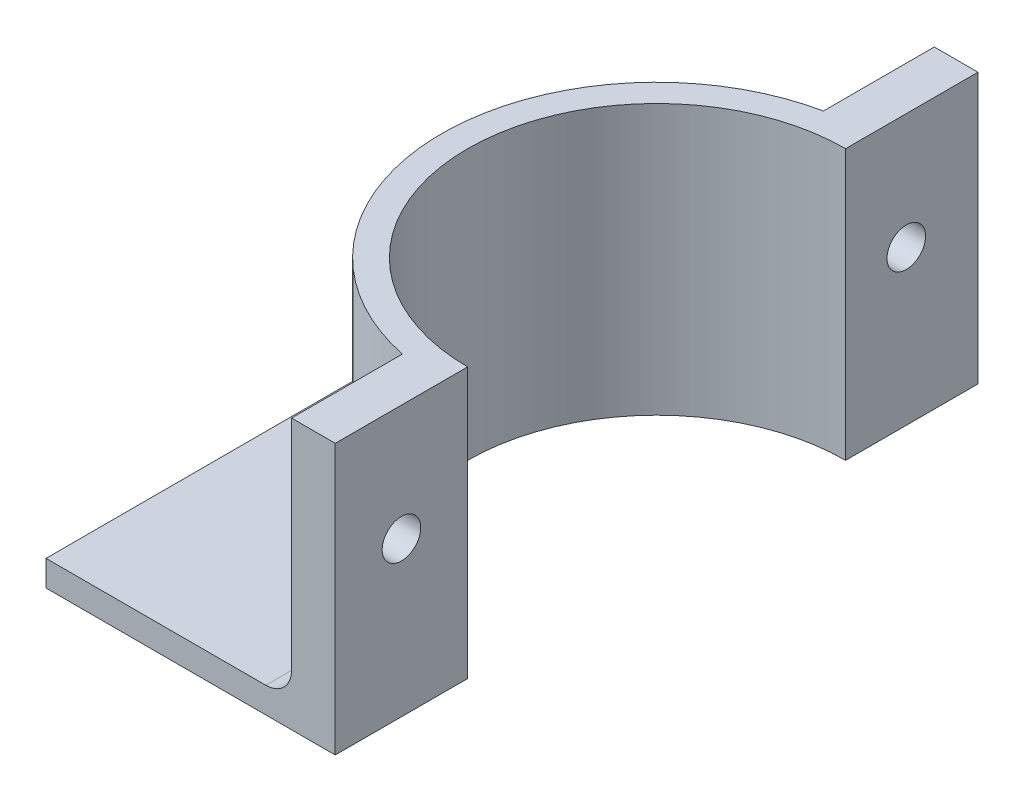
ISO-10303-21;
HEADER;
FILE_DESCRIPTION(('STEP AP214'),'2;1');
FILE_NAME('part.step','',(''),(''),'','','');
FILE_SCHEMA(('AUTOMOTIVE_DESIGN { 1 0 10303 214 1 1 1 1 }'));
ENDSEC;
DATA;
#1=APPLICATION_CONTEXT('core data for automotive mechanical design processes');
#2=APPLICATION_PROTOCOL_DEFINITION('international standard','automotive_design',2000,#1);
#3=PRODUCT_CONTEXT('',#1,'mechanical');
#4=PRODUCT('Part','Part','',(#3));
#5=PRODUCT_RELATED_PRODUCT_CATEGORY('part','',(#4));
#6=PRODUCT_DEFINITION_FORMATION('','',#4);
#7=PRODUCT_DEFINITION_CONTEXT('part definition',#1,'design');
#8=PRODUCT_DEFINITION('design','',#6,#7);
#9=PRODUCT_DEFINITION_SHAPE('','',#8);
#10=(LENGTH_UNIT() NAMED_UNIT(*) SI_UNIT(.MILLI.,.METRE.));
#11=(NAMED_UNIT(*) PLANE_ANGLE_UNIT() SI_UNIT($,.RADIAN.));
#12=(NAMED_UNIT(*) SI_UNIT($,.STERADIAN.) SOLID_ANGLE_UNIT());
#13=UNCERTAINTY_MEASURE_WITH_UNIT(LENGTH_MEASURE(1.E-05),#10,'distance_accuracy_value','');
#14=(GEOMETRIC_REPRESENTATION_CONTEXT(3) GLOBAL_UNCERTAINTY_ASSIGNED_CONTEXT((#13)) GLOBAL_UNIT_ASSIGNED_CONTEXT((#10,
#11,#12)) REPRESENTATION_CONTEXT('',''));
#15=CARTESIAN_POINT('',(0.,0.,0.));
#16=DIRECTION('',(0.,0.,1.));
#17=DIRECTION('',(1.,0.,0.));
#18=AXIS2_PLACEMENT_3D('',#15,#16,#17);
#19=CARTESIAN_POINT('',(0.,2.54,-63.5));
#20=DIRECTION('',(0.,0.,-1.));
#21=DIRECTION('',(-1.,0.,0.));
#22=AXIS2_PLACEMENT_3D('',#19,#20,#21);
#23=PLANE('',#22);
#24=DIRECTION('',(1.,0.,0.));
#25=VECTOR('',#24,1.);
#26=CARTESIAN_POINT('',(0.,0.,-63.5));
#27=LINE('',#26,#25);
#28=CARTESIAN_POINT('',(0.,0.,-63.5));
#29=VERTEX_POINT('',#28);
#30=CARTESIAN_POINT('',(28.575,0.,-63.5));
#31=VERTEX_POINT('',#30);
#32=EDGE_CURVE('E169',#29,#31,#27,.T.);
#33=ORIENTED_EDGE('',*,*,#32,.F.);
#34=DIRECTION('',(0.,-1.,0.));
#35=VECTOR('',#34,1.);
#36=CARTESIAN_POINT('',(0.,2.54,-63.5));
#37=LINE('',#36,#35);
#38=CARTESIAN_POINT('',(0.,2.54,-63.5));
#39=VERTEX_POINT('',#38);
#40=EDGE_CURVE('E200',#39,#29,#37,.T.);
#41=ORIENTED_EDGE('',*,*,#40,.F.);
#42=DIRECTION('',(1.,0.,0.));
#43=VECTOR('',#42,1.);
#44=CARTESIAN_POINT('',(0.,2.54,-63.5));
#45=LINE('',#44,#43);
#46=CARTESIAN_POINT('',(21.717,2.54,-63.5));
#47=VERTEX_POINT('',#46);
#48=EDGE_CURVE('E179',#39,#47,#45,.T.);
#49=ORIENTED_EDGE('',*,*,#48,.T.);
#50=CARTESIAN_POINT('',(21.717,5.08,-63.5));
#51=DIRECTION('',(0.,0.,-1.));
#52=DIRECTION('',(-1.,0.,0.));
#53=AXIS2_PLACEMENT_3D('',#50,#51,#52);
#54=CIRCLE('',#53,2.54);
#55=CARTESIAN_POINT('',(24.257,5.08,-63.5));
#56=VERTEX_POINT('',#55);
#57=EDGE_CURVE('E60',#47,#56,#54,.F.);
#58=ORIENTED_EDGE('',*,*,#57,.T.);
#59=DIRECTION('',(0.,-1.,0.));
#60=VECTOR('',#59,1.);
#61=CARTESIAN_POINT('',(24.257,26.67,-63.5));
#62=LINE('',#61,#60);
#63=CARTESIAN_POINT('',(24.257,26.67,-63.5));
#64=VERTEX_POINT('',#63);
#65=EDGE_CURVE('E328',#64,#56,#62,.T.);
#66=ORIENTED_EDGE('',*,*,#65,.F.);
#67=DIRECTION('',(1.,0.,0.));
#68=VECTOR('',#67,1.);
#69=CARTESIAN_POINT('',(0.,26.67,-63.5));
#70=LINE('',#69,#68);
#71=CARTESIAN_POINT('',(28.575,26.67,-63.5));
#72=VERTEX_POINT('',#71);
#73=EDGE_CURVE('E158',#64,#72,#70,.T.);
#74=ORIENTED_EDGE('',*,*,#73,.T.);
#75=DIRECTION('',(0.,-1.,0.));
#76=VECTOR('',#75,1.);
#77=CARTESIAN_POINT('',(28.575,26.67,-63.5));
#78=LINE('',#77,#76);
#79=EDGE_CURVE('E338',#72,#31,#78,.T.);
#80=ORIENTED_EDGE('',*,*,#79,.T.);
#81=EDGE_LOOP('',(#33,#41,#49,#58,#66,#74,#80));
#82=FACE_BOUND('',#81,.T.);
#83=ADVANCED_FACE('F45',(#82),#23,.T.);
#84=CARTESIAN_POINT('',(0.,2.54,0.));
#85=DIRECTION('',(-1.,0.,0.));
#86=DIRECTION('',(0.,0.,1.));
#87=AXIS2_PLACEMENT_3D('',#84,#85,#86);
#88=PLANE('',#87);
#89=DIRECTION('',(0.,0.,-1.));
#90=VECTOR('',#89,1.);
#91=CARTESIAN_POINT('',(0.,0.,0.));
#92=LINE('',#91,#90);
#93=CARTESIAN_POINT('',(0.,0.,0.));
#94=VERTEX_POINT('',#93);
#95=EDGE_CURVE('E173',#94,#29,#92,.T.);
#96=ORIENTED_EDGE('',*,*,#95,.F.);
#97=DIRECTION('',(0.,-1.,0.));
#98=VECTOR('',#97,1.);
#99=CARTESIAN_POINT('',(0.,2.54,0.));
#100=LINE('',#99,#98);
#101=CARTESIAN_POINT('',(0.,2.54,0.));
#102=VERTEX_POINT('',#101);
#103=EDGE_CURVE('E190',#102,#94,#100,.T.);
#104=ORIENTED_EDGE('',*,*,#103,.F.);
#105=DIRECTION('',(0.,0.,-1.));
#106=VECTOR('',#105,1.);
#107=CARTESIAN_POINT('',(0.,2.54,0.));
#108=LINE('',#107,#106);
#109=EDGE_CURVE('E183',#102,#39,#108,.T.);
#110=ORIENTED_EDGE('',*,*,#109,.T.);
#111=ORIENTED_EDGE('',*,*,#40,.T.);
#112=EDGE_LOOP('',(#96,#104,#110,#111));
#113=FACE_BOUND('',#112,.T.);
#114=ADVANCED_FACE('F243',(#113),#88,.T.);
#115=CARTESIAN_POINT('',(0.,2.54,0.));
#116=DIRECTION('',(0.,0.,1.));
#117=DIRECTION('',(1.,0.,0.));
#118=AXIS2_PLACEMENT_3D('',#115,#116,#117);
#119=PLANE('',#118);
#120=DIRECTION('',(-1.,0.,0.));
#121=VECTOR('',#120,1.);
#122=CARTESIAN_POINT('',(0.,0.,0.));
#123=LINE('',#122,#121);
#124=CARTESIAN_POINT('',(28.575,0.,0.));
#125=VERTEX_POINT('',#124);
#126=EDGE_CURVE('E184',#125,#94,#123,.T.);
#127=ORIENTED_EDGE('',*,*,#126,.F.);
#128=DIRECTION('',(0.,-1.,0.));
#129=VECTOR('',#128,1.);
#130=CARTESIAN_POINT('',(28.575,26.67,0.));
#131=LINE('',#130,#129);
#132=CARTESIAN_POINT('',(28.575,26.67,0.));
#133=VERTEX_POINT('',#132);
#134=EDGE_CURVE('E348',#133,#125,#131,.T.);
#135=ORIENTED_EDGE('',*,*,#134,.F.);
#136=DIRECTION('',(-1.,0.,0.));
#137=VECTOR('',#136,1.);
#138=CARTESIAN_POINT('',(0.,26.67,0.));
#139=LINE('',#138,#137);
#140=CARTESIAN_POINT('',(24.257,26.67,0.));
#141=VERTEX_POINT('',#140);
#142=EDGE_CURVE('E313',#133,#141,#139,.T.);
#143=ORIENTED_EDGE('',*,*,#142,.T.);
#144=DIRECTION('',(0.,-1.,0.));
#145=VECTOR('',#144,1.);
#146=CARTESIAN_POINT('',(24.257,26.67,0.));
#147=LINE('',#146,#145);
#148=CARTESIAN_POINT('',(24.257,5.08,0.));
#149=VERTEX_POINT('',#148);
#150=EDGE_CURVE('E175',#141,#149,#147,.T.);
#151=ORIENTED_EDGE('',*,*,#150,.T.);
#152=CARTESIAN_POINT('',(21.717,5.08,0.));
#153=DIRECTION('',(0.,0.,1.));
#154=DIRECTION('',(1.,0.,0.));
#155=AXIS2_PLACEMENT_3D('',#152,#153,#154);
#156=CIRCLE('',#155,2.54);
#157=CARTESIAN_POINT('',(21.717,2.54,0.));
#158=VERTEX_POINT('',#157);
#159=EDGE_CURVE('E11',#149,#158,#156,.F.);
#160=ORIENTED_EDGE('',*,*,#159,.T.);
#161=DIRECTION('',(-1.,0.,0.));
#162=VECTOR('',#161,1.);
#163=CARTESIAN_POINT('',(0.,2.54,0.));
#164=LINE('',#163,#162);
#165=EDGE_CURVE('E188',#158,#102,#164,.T.);
#166=ORIENTED_EDGE('',*,*,#165,.T.);
#167=ORIENTED_EDGE('',*,*,#103,.T.);
#168=EDGE_LOOP('',(#127,#135,#143,#151,#160,#166,#167));
#169=FACE_BOUND('',#168,.T.);
#170=ADVANCED_FACE('F248',(#169),#119,.T.);
#171=CARTESIAN_POINT('',(0.,2.54,0.));
#172=DIRECTION('',(0.,1.,0.));
#173=DIRECTION('',(0.,0.,1.));
#174=AXIS2_PLACEMENT_3D('',#171,#172,#173);
#175=PLANE('',#174);
#176=CARTESIAN_POINT('',(28.575,2.54,-31.75));
#177=DIRECTION('',(0.,1.,0.));
#178=DIRECTION('',(0.,0.,1.));
#179=AXIS2_PLACEMENT_3D('',#176,#177,#178);
#180=CIRCLE('',#179,23.7801567555421);
#181=CARTESIAN_POINT('',(21.717,2.54,-8.98020221174212));
#182=VERTEX_POINT('',#181);
#183=CARTESIAN_POINT('',(21.717,2.54,-54.5197977882579));
#184=VERTEX_POINT('',#183);
#185=EDGE_CURVE('E208',#182,#184,#180,.F.);
#186=ORIENTED_EDGE('',*,*,#185,.T.);
#187=DIRECTION('',(0.,0.,1.));
#188=VECTOR('',#187,1.);
#189=CARTESIAN_POINT('',(21.717,2.54,0.));
#190=LINE('',#189,#188);
#191=EDGE_CURVE('E211',#184,#47,#190,.F.);
#192=ORIENTED_EDGE('',*,*,#191,.T.);
#193=ORIENTED_EDGE('',*,*,#48,.F.);
#194=ORIENTED_EDGE('',*,*,#109,.F.);
#195=ORIENTED_EDGE('',*,*,#165,.F.);
#196=DIRECTION('',(0.,0.,-1.));
#197=VECTOR('',#196,1.);
#198=CARTESIAN_POINT('',(21.717,2.54,-10.9533864535593));
#199=LINE('',#198,#197);
#200=EDGE_CURVE('E205',#158,#182,#199,.T.);
#201=ORIENTED_EDGE('',*,*,#200,.T.);
#202=EDGE_LOOP('',(#186,#192,#193,#194,#195,#201));
#203=FACE_BOUND('',#202,.T.);
#204=ADVANCED_FACE('F255',(#203),#175,.T.);
#205=CARTESIAN_POINT('',(0.,0.,0.));
#206=DIRECTION('',(0.,1.,0.));
#207=DIRECTION('',(0.,0.,1.));
#208=AXIS2_PLACEMENT_3D('',#205,#206,#207);
#209=PLANE('',#208);
#210=ORIENTED_EDGE('',*,*,#32,.T.);
#211=DIRECTION('',(0.,0.,1.));
#212=VECTOR('',#211,1.);
#213=CARTESIAN_POINT('',(28.575,0.,0.));
#214=LINE('',#213,#212);
#215=CARTESIAN_POINT('',(28.575,0.,-50.419));
#216=VERTEX_POINT('',#215);
#217=EDGE_CURVE('E162',#31,#216,#214,.T.);
#218=ORIENTED_EDGE('',*,*,#217,.T.);
#219=CARTESIAN_POINT('',(28.575,0.,-31.75));
#220=DIRECTION('',(0.,1.,0.));
#221=DIRECTION('',(0.,0.,1.));
#222=AXIS2_PLACEMENT_3D('',#219,#220,#221);
#223=CIRCLE('',#222,18.669);
#224=CARTESIAN_POINT('',(28.575,0.,-13.081));
#225=VERTEX_POINT('',#224);
#226=EDGE_CURVE('E332',#216,#225,#223,.T.);
#227=ORIENTED_EDGE('',*,*,#226,.T.);
#228=EDGE_CURVE('E305',#225,#125,#214,.T.);
#229=ORIENTED_EDGE('',*,*,#228,.T.);
#230=ORIENTED_EDGE('',*,*,#126,.T.);
#231=ORIENTED_EDGE('',*,*,#95,.T.);
#232=EDGE_LOOP('',(#210,#218,#227,#229,#230,#231));
#233=FACE_BOUND('',#232,.T.);
#234=ADVANCED_FACE('F257',(#233),#209,.F.);
#235=CARTESIAN_POINT('',(24.257,26.67,0.));
#236=DIRECTION('',(1.,0.,0.));
#237=DIRECTION('',(0.,0.,-1.));
#238=AXIS2_PLACEMENT_3D('',#235,#236,#237);
#239=PLANE('',#238);
#240=CARTESIAN_POINT('',(24.257,15.24,-56.417624590122));
#241=DIRECTION('',(1.,0.,0.));
#242=DIRECTION('',(0.,0.,-1.));
#243=AXIS2_PLACEMENT_3D('',#240,#241,#242);
#244=CIRCLE('',#243,1.905);
#245=CARTESIAN_POINT('',(24.257,15.24,-58.322624590122));
#246=VERTEX_POINT('',#245);
#247=EDGE_CURVE('E298',#246,#246,#244,.F.);
#248=ORIENTED_EDGE('',*,*,#247,.F.);
#249=EDGE_LOOP('',(#248));
#250=FACE_BOUND('',#249,.T.);
#251=ORIENTED_EDGE('',*,*,#65,.T.);
#252=DIRECTION('',(0.,0.,1.));
#253=VECTOR('',#252,1.);
#254=CARTESIAN_POINT('',(24.257,5.08,0.));
#255=LINE('',#254,#253);
#256=CARTESIAN_POINT('',(24.257,5.08,-52.5466135464407));
#257=VERTEX_POINT('',#256);
#258=EDGE_CURVE('E167',#56,#257,#255,.T.);
#259=ORIENTED_EDGE('',*,*,#258,.T.);
#260=DIRECTION('',(0.,-1.,0.));
#261=VECTOR('',#260,1.);
#262=CARTESIAN_POINT('',(24.257,26.67,-52.5466135464407));
#263=LINE('',#262,#261);
#264=CARTESIAN_POINT('',(24.257,26.67,-52.5466135464407));
#265=VERTEX_POINT('',#264);
#266=EDGE_CURVE('E144',#265,#257,#263,.T.);
#267=ORIENTED_EDGE('',*,*,#266,.F.);
#268=DIRECTION('',(0.,0.,1.));
#269=VECTOR('',#268,1.);
#270=CARTESIAN_POINT('',(24.257,26.67,0.));
#271=LINE('',#270,#269);
#272=EDGE_CURVE('E151',#64,#265,#271,.T.);
#273=ORIENTED_EDGE('',*,*,#272,.F.);
#274=EDGE_LOOP('',(#251,#259,#267,#273));
#275=FACE_BOUND('',#274,.T.);
#276=ADVANCED_FACE('F165',(#250,#275),#239,.F.);
#277=CARTESIAN_POINT('',(28.575,26.67,-31.75));
#278=DIRECTION('',(0.,-1.,0.));
#279=DIRECTION('',(0.,0.,-1.));
#280=AXIS2_PLACEMENT_3D('',#277,#278,#279);
#281=CYLINDRICAL_SURFACE('',#280,21.2401567555421);
#282=ORIENTED_EDGE('',*,*,#266,.T.);
#283=CARTESIAN_POINT('',(28.575,5.08,-31.75));
#284=DIRECTION('',(0.,1.,0.));
#285=DIRECTION('',(0.,0.,1.));
#286=AXIS2_PLACEMENT_3D('',#283,#284,#285);
#287=CIRCLE('',#286,21.2401567555421);
#288=CARTESIAN_POINT('',(24.257,5.08,-10.9533864535593));
#289=VERTEX_POINT('',#288);
#290=EDGE_CURVE('E76',#257,#289,#287,.T.);
#291=ORIENTED_EDGE('',*,*,#290,.T.);
#292=DIRECTION('',(0.,-1.,0.));
#293=VECTOR('',#292,1.);
#294=CARTESIAN_POINT('',(24.257,26.67,-10.9533864535593));
#295=LINE('',#294,#293);
#296=CARTESIAN_POINT('',(24.257,26.67,-10.9533864535593));
#297=VERTEX_POINT('',#296);
#298=EDGE_CURVE('E145',#297,#289,#295,.T.);
#299=ORIENTED_EDGE('',*,*,#298,.F.);
#300=CARTESIAN_POINT('',(28.575,26.67,-31.75));
#301=DIRECTION('',(0.,1.,0.));
#302=DIRECTION('',(0.,0.,1.));
#303=AXIS2_PLACEMENT_3D('',#300,#301,#302);
#304=CIRCLE('',#303,21.2401567555421);
#305=EDGE_CURVE('E140',#265,#297,#304,.T.);
#306=ORIENTED_EDGE('',*,*,#305,.F.);
#307=EDGE_LOOP('',(#282,#291,#299,#306));
#308=FACE_BOUND('',#307,.T.);
#309=ADVANCED_FACE('F142',(#308),#281,.T.);
#310=CARTESIAN_POINT('',(24.257,26.67,0.));
#311=DIRECTION('',(-1.,0.,0.));
#312=DIRECTION('',(0.,0.,1.));
#313=AXIS2_PLACEMENT_3D('',#310,#311,#312);
#314=PLANE('',#313);
#315=CARTESIAN_POINT('',(24.257,15.24,-6.5405));
#316=DIRECTION('',(-1.,0.,0.));
#317=DIRECTION('',(0.,0.,1.));
#318=AXIS2_PLACEMENT_3D('',#315,#316,#317);
#319=CIRCLE('',#318,1.905);
#320=CARTESIAN_POINT('',(24.257,15.24,-4.6355));
#321=VERTEX_POINT('',#320);
#322=EDGE_CURVE('E300',#321,#321,#319,.F.);
#323=ORIENTED_EDGE('',*,*,#322,.T.);
#324=EDGE_LOOP('',(#323));
#325=FACE_BOUND('',#324,.T.);
#326=ORIENTED_EDGE('',*,*,#298,.T.);
#327=DIRECTION('',(0.,0.,-1.));
#328=VECTOR('',#327,1.);
#329=CARTESIAN_POINT('',(24.257,5.08,0.));
#330=LINE('',#329,#328);
#331=EDGE_CURVE('E68',#289,#149,#330,.F.);
#332=ORIENTED_EDGE('',*,*,#331,.T.);
#333=ORIENTED_EDGE('',*,*,#150,.F.);
#334=DIRECTION('',(0.,0.,-1.));
#335=VECTOR('',#334,1.);
#336=CARTESIAN_POINT('',(24.257,26.67,0.));
#337=LINE('',#336,#335);
#338=EDGE_CURVE('E150',#141,#297,#337,.T.);
#339=ORIENTED_EDGE('',*,*,#338,.T.);
#340=EDGE_LOOP('',(#326,#332,#333,#339));
#341=FACE_BOUND('',#340,.T.);
#342=ADVANCED_FACE('F269',(#325,#341),#314,.T.);
#343=CARTESIAN_POINT('',(28.575,26.67,0.));
#344=DIRECTION('',(1.,0.,0.));
#345=DIRECTION('',(0.,0.,-1.));
#346=AXIS2_PLACEMENT_3D('',#343,#344,#345);
#347=PLANE('',#346);
#348=CARTESIAN_POINT('',(28.575,15.24,-6.5405));
#349=DIRECTION('',(1.,0.,0.));
#350=DIRECTION('',(0.,0.,-1.));
#351=AXIS2_PLACEMENT_3D('',#348,#349,#350);
#352=CIRCLE('',#351,1.905);
#353=CARTESIAN_POINT('',(28.575,15.24,-8.4455));
#354=VERTEX_POINT('',#353);
#355=EDGE_CURVE('E307',#354,#354,#352,.T.);
#356=ORIENTED_EDGE('',*,*,#355,.F.);
#357=EDGE_LOOP('',(#356));
#358=FACE_BOUND('',#357,.T.);
#359=ORIENTED_EDGE('',*,*,#228,.F.);
#360=DIRECTION('',(0.,-1.,0.));
#361=VECTOR('',#360,1.);
#362=CARTESIAN_POINT('',(28.575,26.67,-13.081));
#363=LINE('',#362,#361);
#364=CARTESIAN_POINT('',(28.575,26.67,-13.081));
#365=VERTEX_POINT('',#364);
#366=EDGE_CURVE('E345',#365,#225,#363,.T.);
#367=ORIENTED_EDGE('',*,*,#366,.F.);
#368=DIRECTION('',(0.,0.,1.));
#369=VECTOR('',#368,1.);
#370=CARTESIAN_POINT('',(28.575,26.67,0.));
#371=LINE('',#370,#369);
#372=EDGE_CURVE('E317',#365,#133,#371,.T.);
#373=ORIENTED_EDGE('',*,*,#372,.T.);
#374=ORIENTED_EDGE('',*,*,#134,.T.);
#375=EDGE_LOOP('',(#359,#367,#373,#374));
#376=FACE_BOUND('',#375,.T.);
#377=ADVANCED_FACE('F272',(#358,#376),#347,.T.);
#378=CARTESIAN_POINT('',(28.575,26.67,-31.75));
#379=DIRECTION('',(0.,-1.,0.));
#380=DIRECTION('',(0.,0.,-1.));
#381=AXIS2_PLACEMENT_3D('',#378,#379,#380);
#382=CYLINDRICAL_SURFACE('',#381,18.669);
#383=ORIENTED_EDGE('',*,*,#226,.F.);
#384=DIRECTION('',(0.,-1.,0.));
#385=VECTOR('',#384,1.);
#386=CARTESIAN_POINT('',(28.575,26.67,-50.419));
#387=LINE('',#386,#385);
#388=CARTESIAN_POINT('',(28.575,26.67,-50.419));
#389=VERTEX_POINT('',#388);
#390=EDGE_CURVE('E342',#389,#216,#387,.T.);
#391=ORIENTED_EDGE('',*,*,#390,.F.);
#392=CARTESIAN_POINT('',(28.575,26.67,-31.75));
#393=DIRECTION('',(0.,1.,0.));
#394=DIRECTION('',(0.,0.,1.));
#395=AXIS2_PLACEMENT_3D('',#392,#393,#394);
#396=CIRCLE('',#395,18.669);
#397=EDGE_CURVE('E321',#389,#365,#396,.T.);
#398=ORIENTED_EDGE('',*,*,#397,.T.);
#399=ORIENTED_EDGE('',*,*,#366,.T.);
#400=EDGE_LOOP('',(#383,#391,#398,#399));
#401=FACE_BOUND('',#400,.T.);
#402=ADVANCED_FACE('F274',(#401),#382,.F.);
#403=CARTESIAN_POINT('',(28.575,15.24,-56.417624590122));
#404=DIRECTION('',(1.,0.,0.));
#405=DIRECTION('',(0.,0.,-1.));
#406=AXIS2_PLACEMENT_3D('',#403,#404,#405);
#407=CIRCLE('',#406,1.905);
#408=CARTESIAN_POINT('',(28.575,15.24,-58.322624590122));
#409=VERTEX_POINT('',#408);
#410=EDGE_CURVE('E295',#409,#409,#407,.T.);
#411=ORIENTED_EDGE('',*,*,#410,.F.);
#412=EDGE_LOOP('',(#411));
#413=FACE_BOUND('',#412,.T.);
#414=ORIENTED_EDGE('',*,*,#217,.F.);
#415=ORIENTED_EDGE('',*,*,#79,.F.);
#416=EDGE_CURVE('E322',#72,#389,#371,.T.);
#417=ORIENTED_EDGE('',*,*,#416,.T.);
#418=ORIENTED_EDGE('',*,*,#390,.T.);
#419=EDGE_LOOP('',(#414,#415,#417,#418));
#420=FACE_BOUND('',#419,.T.);
#421=ADVANCED_FACE('F277',(#413,#420),#347,.T.);
#422=CARTESIAN_POINT('',(0.,26.67,0.));
#423=DIRECTION('',(0.,1.,0.));
#424=DIRECTION('',(0.,0.,1.));
#425=AXIS2_PLACEMENT_3D('',#422,#423,#424);
#426=PLANE('',#425);
#427=ORIENTED_EDGE('',*,*,#272,.T.);
#428=ORIENTED_EDGE('',*,*,#305,.T.);
#429=ORIENTED_EDGE('',*,*,#338,.F.);
#430=ORIENTED_EDGE('',*,*,#142,.F.);
#431=ORIENTED_EDGE('',*,*,#372,.F.);
#432=ORIENTED_EDGE('',*,*,#397,.F.);
#433=ORIENTED_EDGE('',*,*,#416,.F.);
#434=ORIENTED_EDGE('',*,*,#73,.F.);
#435=EDGE_LOOP('',(#427,#428,#429,#430,#431,#432,#433,#434));
#436=FACE_BOUND('',#435,.T.);
#437=ADVANCED_FACE('F155',(#436),#426,.T.);
#438=CARTESIAN_POINT('',(28.575,15.24,-56.417624590122));
#439=DIRECTION('',(-1.,0.,0.));
#440=DIRECTION('',(0.,0.,1.));
#441=AXIS2_PLACEMENT_3D('',#438,#439,#440);
#442=CYLINDRICAL_SURFACE('',#441,1.905);
#443=ORIENTED_EDGE('',*,*,#410,.T.);
#444=EDGE_LOOP('',(#443));
#445=FACE_BOUND('',#444,.T.);
#446=ORIENTED_EDGE('',*,*,#247,.T.);
#447=EDGE_LOOP('',(#446));
#448=FACE_BOUND('',#447,.T.);
#449=ADVANCED_FACE('F284',(#445,#448),#442,.F.);
#450=CARTESIAN_POINT('',(28.575,15.24,-6.5405));
#451=DIRECTION('',(-1.,0.,0.));
#452=DIRECTION('',(0.,0.,1.));
#453=AXIS2_PLACEMENT_3D('',#450,#451,#452);
#454=CYLINDRICAL_SURFACE('',#453,1.905);
#455=ORIENTED_EDGE('',*,*,#322,.F.);
#456=EDGE_LOOP('',(#455));
#457=FACE_BOUND('',#456,.T.);
#458=ORIENTED_EDGE('',*,*,#355,.T.);
#459=EDGE_LOOP('',(#458));
#460=FACE_BOUND('',#459,.T.);
#461=ADVANCED_FACE('F239',(#457,#460),#454,.F.);
#462=CARTESIAN_POINT('',(21.717,5.08,0.));
#463=DIRECTION('',(0.,0.,1.));
#464=DIRECTION('',(1.,0.,0.));
#465=AXIS2_PLACEMENT_3D('',#462,#463,#464);
#466=CYLINDRICAL_SURFACE('',#465,2.54);
#467=ORIENTED_EDGE('',*,*,#159,.F.);
#468=ORIENTED_EDGE('',*,*,#331,.F.);
#469=CARTESIAN_POINT('',(24.257,5.08,-10.9533864535593));
#470=CARTESIAN_POINT('',(24.2570131281613,5.01959786979868,-10.9533980416884));
#471=CARTESIAN_POINT('',(24.2548458435975,4.95920495446935,-10.9516336412252));
#472=CARTESIAN_POINT('',(24.2462514936439,4.83896000383438,-10.9446417234508));
#473=CARTESIAN_POINT('',(24.239826981227,4.77910766614615,-10.9394162816566));
#474=CARTESIAN_POINT('',(24.2228776496631,4.66080215984382,-10.9256386223106));
#475=CARTESIAN_POINT('',(24.2123814155046,4.60234218831224,-10.9171095977476));
#476=CARTESIAN_POINT('',(24.1874751738772,4.48683180580793,-10.8968885461002));
#477=CARTESIAN_POINT('',(24.1730647561636,4.4297815432706,-10.8851961874681));
#478=CARTESIAN_POINT('',(24.1243494753712,4.26156273822825,-10.8457110749503));
#479=CARTESIAN_POINT('',(24.0845075566307,4.15296841691072,-10.813467008867));
#480=CARTESIAN_POINT('',(23.9921475212691,3.94495640487381,-10.7389488258945));
#481=CARTESIAN_POINT('',(23.9396064547477,3.84555578387949,-10.6966565522642));
#482=CARTESIAN_POINT('',(23.8053789985552,3.62686958703567,-10.5890059634588));
#483=CARTESIAN_POINT('',(23.7197556263331,3.51148865981863,-10.520605542621));
#484=CARTESIAN_POINT('',(23.5345616112048,3.30014212100196,-10.3734941994385));
#485=CARTESIAN_POINT('',(23.4349687626493,3.204208027322,-10.2947668747924));
#486=CARTESIAN_POINT('',(23.1993800824163,3.01050400186894,-10.1096655136413));
#487=CARTESIAN_POINT('',(23.060484873263,2.91819037582434,-10.0012799484848));
#488=CARTESIAN_POINT('',(22.7718761967439,2.76361085693342,-9.77786693261939));
#489=CARTESIAN_POINT('',(22.6221581665902,2.70135772322049,-9.66283668473633));
#490=CARTESIAN_POINT('',(22.3480203792174,2.61636341372664,-9.45390613216408));
#491=CARTESIAN_POINT('',(22.2248174363353,2.58809653511749,-9.36058851869649));
#492=CARTESIAN_POINT('',(21.9762186684319,2.55014523117224,-9.17347832548716));
#493=CARTESIAN_POINT('',(21.8508279440581,2.54042223276459,-9.07968713945554));
#494=CARTESIAN_POINT('',(21.7225115992455,2.54000448288766,-8.98429862050277));
#495=CARTESIAN_POINT('',(21.719755834995,2.5399999978158,-8.98225030330875));
#496=CARTESIAN_POINT('',(21.717,2.54,-8.98020221174212));
#497=B_SPLINE_CURVE_WITH_KNOTS('',3,(#469,#470,#471,#472,#473,#474,#475,#476,#477,#478,#479,
#480,#481,#482,#483,#484,#485,#486,#487,#488,#489,#490,#491,#492,#493,#494,#495,#496),
.UNSPECIFIED.,.F.,.F.,(4,2,2,2,2,2,2,2,2,2,2,2,2,4),(0.,0.181126655860122,0.362144791923684,
0.541914464575691,0.721702986114637,1.0802015354025,1.43935287225414,1.91416192689136,
2.38973446862962,2.98336602681218,3.57724933007204,4.0475815581066,4.5169343778467,
4.52723527366928),.UNSPECIFIED.);
#498=EDGE_CURVE('E50',#182,#289,#497,.F.);
#499=ORIENTED_EDGE('',*,*,#498,.F.);
#500=ORIENTED_EDGE('',*,*,#200,.F.);
#501=EDGE_LOOP('',(#467,#468,#499,#500));
#502=FACE_BOUND('',#501,.T.);
#503=ADVANCED_FACE('F47',(#502),#466,.F.);
#504=CARTESIAN_POINT('',(28.575,5.08,-31.75));
#505=DIRECTION('',(0.,1.,0.));
#506=DIRECTION('',(0.,0.,1.));
#507=AXIS2_PLACEMENT_3D('',#504,#505,#506);
#508=TOROIDAL_SURFACE('',#507,23.7801567555421,2.54);
#509=ORIENTED_EDGE('',*,*,#498,.T.);
#510=ORIENTED_EDGE('',*,*,#290,.F.);
#511=CARTESIAN_POINT('',(24.257,5.08,-52.5466135464407));
#512=CARTESIAN_POINT('',(24.2570131281613,5.01959786979868,-52.5466019583116));
#513=CARTESIAN_POINT('',(24.2548458435975,4.95920495446936,-52.5483663587748));
#514=CARTESIAN_POINT('',(24.2462514936439,4.83896000383438,-52.5553582765492));
#515=CARTESIAN_POINT('',(24.239826981227,4.77910766614615,-52.5605837183434));
#516=CARTESIAN_POINT('',(24.2228776496631,4.66080215984382,-52.5743613776894));
#517=CARTESIAN_POINT('',(24.2123814155046,4.60234218831224,-52.5828904022524));
#518=CARTESIAN_POINT('',(24.1874751738771,4.48683180580793,-52.6031114538998));
#519=CARTESIAN_POINT('',(24.1730647561636,4.4297815432706,-52.6148038125319));
#520=CARTESIAN_POINT('',(24.1243494753712,4.26156273822825,-52.6542889250497));
#521=CARTESIAN_POINT('',(24.0845075566307,4.15296841691072,-52.686532991133));
#522=CARTESIAN_POINT('',(23.9921475212691,3.94495640487381,-52.7610511741055));
#523=CARTESIAN_POINT('',(23.9396064547477,3.84555578387949,-52.8033434477358));
#524=CARTESIAN_POINT('',(23.8053789985551,3.62686958703568,-52.9109940365412));
#525=CARTESIAN_POINT('',(23.7197556263331,3.51148865981863,-52.979394457379));
#526=CARTESIAN_POINT('',(23.5345616112048,3.30014212100196,-53.1265058005615));
#527=CARTESIAN_POINT('',(23.4349687626493,3.204208027322,-53.2052331252076));
#528=CARTESIAN_POINT('',(23.1993800824163,3.01050400186893,-53.3903344863587));
#529=CARTESIAN_POINT('',(23.060484873263,2.91819037582433,-53.4987200515153));
#530=CARTESIAN_POINT('',(22.7718761967437,2.76361085693341,-53.7221330673805));
#531=CARTESIAN_POINT('',(22.6221581665898,2.70135772322049,-53.8371633152632));
#532=CARTESIAN_POINT('',(22.3480203792177,2.61636341372664,-54.0460938678363));
#533=CARTESIAN_POINT('',(22.2248174363363,2.5880965351175,-54.1394114813048));
#534=CARTESIAN_POINT('',(21.976218668431,2.55014523117224,-54.3265216745115));
#535=CARTESIAN_POINT('',(21.8508279440544,2.54042223276459,-54.4203128605395));
#536=CARTESIAN_POINT('',(21.7225115992453,2.54000448288766,-54.515701379497));
#537=CARTESIAN_POINT('',(21.7197558349949,2.5399999978158,-54.5177496966911));
#538=CARTESIAN_POINT('',(21.717,2.54,-54.5197977882579));
#539=B_SPLINE_CURVE_WITH_KNOTS('',3,(#511,#512,#513,#514,#515,#516,#517,#518,#519,#520,#521,
#522,#523,#524,#525,#526,#527,#528,#529,#530,#531,#532,#533,#534,#535,#536,#537,#538),
.UNSPECIFIED.,.F.,.F.,(4,2,2,2,2,2,2,2,2,2,2,2,2,4),(0.,0.181126655860121,0.362144791923683,
0.541914464575692,0.721702986114635,1.0802015354025,1.43935287225414,1.91416192689135,
2.38973446862962,2.98336602681222,3.57724933007204,4.04758155810656,4.51693437784669,
4.52723527366927),.UNSPECIFIED.);
#540=EDGE_CURVE('E219',#184,#257,#539,.F.);
#541=ORIENTED_EDGE('',*,*,#540,.F.);
#542=ORIENTED_EDGE('',*,*,#185,.F.);
#543=EDGE_LOOP('',(#509,#510,#541,#542));
#544=FACE_BOUND('',#543,.T.);
#545=ADVANCED_FACE('F229',(#544),#508,.F.);
#546=CARTESIAN_POINT('',(21.717,5.08,0.));
#547=DIRECTION('',(0.,0.,1.));
#548=DIRECTION('',(1.,0.,0.));
#549=AXIS2_PLACEMENT_3D('',#546,#547,#548);
#550=CYLINDRICAL_SURFACE('',#549,2.54);
#551=ORIENTED_EDGE('',*,*,#57,.F.);
#552=ORIENTED_EDGE('',*,*,#191,.F.);
#553=ORIENTED_EDGE('',*,*,#540,.T.);
#554=ORIENTED_EDGE('',*,*,#258,.F.);
#555=EDGE_LOOP('',(#551,#552,#553,#554));
#556=FACE_BOUND('',#555,.T.);
#557=ADVANCED_FACE('F226',(#556),#550,.F.);
#558=CLOSED_SHELL('',(#83,#114,#170,#204,#234,#276,#309,#342,#377,#402,#421,#437,#449,#461,#503,
#545,#557));
#559=MANIFOLD_SOLID_BREP('B2',#558);
#560=ADVANCED_BREP_SHAPE_REPRESENTATION('',(#18,#559),#14);
#561=SHAPE_DEFINITION_REPRESENTATION(#9,#560);
ENDSEC;
END-ISO-10303-21;
